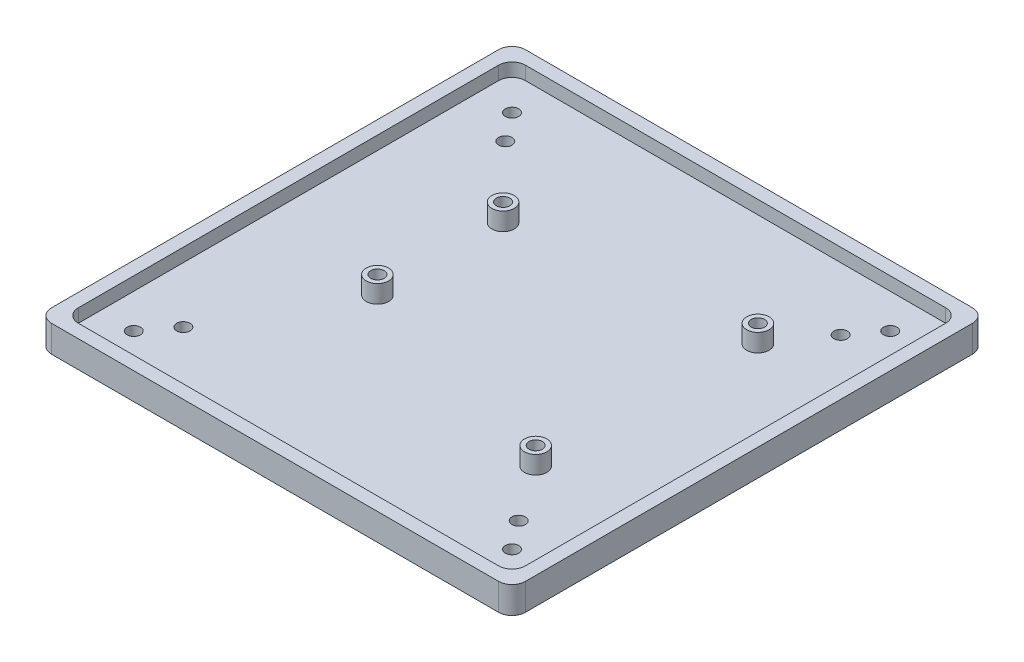
ISO-10303-21;
HEADER;
FILE_DESCRIPTION(('STEP AP214'),'2;1');
FILE_NAME('part.step','',(''),(''),'','','');
FILE_SCHEMA(('AUTOMOTIVE_DESIGN { 1 0 10303 214 1 1 1 1 }'));
ENDSEC;
DATA;
#1=APPLICATION_CONTEXT('core data for automotive mechanical design processes');
#2=APPLICATION_PROTOCOL_DEFINITION('international standard','automotive_design',2000,#1);
#3=PRODUCT_CONTEXT('',#1,'mechanical');
#4=PRODUCT('Part','Part','',(#3));
#5=PRODUCT_RELATED_PRODUCT_CATEGORY('part','',(#4));
#6=PRODUCT_DEFINITION_FORMATION('','',#4);
#7=PRODUCT_DEFINITION_CONTEXT('part definition',#1,'design');
#8=PRODUCT_DEFINITION('design','',#6,#7);
#9=PRODUCT_DEFINITION_SHAPE('','',#8);
#10=(LENGTH_UNIT() NAMED_UNIT(*) SI_UNIT(.MILLI.,.METRE.));
#11=(NAMED_UNIT(*) PLANE_ANGLE_UNIT() SI_UNIT($,.RADIAN.));
#12=(NAMED_UNIT(*) SI_UNIT($,.STERADIAN.) SOLID_ANGLE_UNIT());
#13=UNCERTAINTY_MEASURE_WITH_UNIT(LENGTH_MEASURE(1.E-05),#10,'distance_accuracy_value','');
#14=(GEOMETRIC_REPRESENTATION_CONTEXT(3) GLOBAL_UNCERTAINTY_ASSIGNED_CONTEXT((#13)) GLOBAL_UNIT_ASSIGNED_CONTEXT((#10,
#11,#12)) REPRESENTATION_CONTEXT('',''));
#15=CARTESIAN_POINT('',(0.,0.,0.));
#16=DIRECTION('',(0.,0.,1.));
#17=DIRECTION('',(1.,0.,0.));
#18=AXIS2_PLACEMENT_3D('',#15,#16,#17);
#19=CARTESIAN_POINT('',(0.,3.,0.));
#20=DIRECTION('',(0.,1.,0.));
#21=DIRECTION('',(0.,0.,1.));
#22=AXIS2_PLACEMENT_3D('',#19,#20,#21);
#23=PLANE('',#22);
#24=CARTESIAN_POINT('',(-14.5144151397927,3.,-37.));
#25=DIRECTION('',(0.,1.,0.));
#26=DIRECTION('',(0.,0.,1.));
#27=AXIS2_PLACEMENT_3D('',#24,#25,#26);
#28=CIRCLE('',#27,1.5);
#29=CARTESIAN_POINT('',(-14.5144151397927,3.,-35.5));
#30=VERTEX_POINT('',#29);
#31=EDGE_CURVE('E691',#30,#30,#28,.T.);
#32=ORIENTED_EDGE('',*,*,#31,.F.);
#33=EDGE_LOOP('',(#32));
#34=FACE_BOUND('',#33,.T.);
#35=CARTESIAN_POINT('',(60.4844151397927,3.,35.));
#36=DIRECTION('',(0.,1.,0.));
#37=DIRECTION('',(0.,0.,1.));
#38=AXIS2_PLACEMENT_3D('',#35,#36,#37);
#39=CIRCLE('',#38,1.5);
#40=CARTESIAN_POINT('',(60.4844151397927,3.,36.5));
#41=VERTEX_POINT('',#40);
#42=EDGE_CURVE('E697',#41,#41,#39,.T.);
#43=ORIENTED_EDGE('',*,*,#42,.F.);
#44=EDGE_LOOP('',(#43));
#45=FACE_BOUND('',#44,.T.);
#46=CARTESIAN_POINT('',(60.4844151397927,3.,-37.));
#47=DIRECTION('',(0.,1.,0.));
#48=DIRECTION('',(0.,0.,1.));
#49=AXIS2_PLACEMENT_3D('',#46,#47,#48);
#50=CIRCLE('',#49,1.5);
#51=CARTESIAN_POINT('',(60.4844151397927,3.,-35.5));
#52=VERTEX_POINT('',#51);
#53=EDGE_CURVE('E705',#52,#52,#50,.T.);
#54=ORIENTED_EDGE('',*,*,#53,.F.);
#55=EDGE_LOOP('',(#54));
#56=FACE_BOUND('',#55,.T.);
#57=CARTESIAN_POINT('',(-14.5144151397927,3.,35.));
#58=DIRECTION('',(0.,1.,0.));
#59=DIRECTION('',(0.,0.,1.));
#60=AXIS2_PLACEMENT_3D('',#57,#58,#59);
#61=CIRCLE('',#60,1.5);
#62=CARTESIAN_POINT('',(-14.5144151397927,3.,36.5));
#63=VERTEX_POINT('',#62);
#64=EDGE_CURVE('E694',#63,#63,#61,.T.);
#65=ORIENTED_EDGE('',*,*,#64,.F.);
#66=EDGE_LOOP('',(#65));
#67=FACE_BOUND('',#66,.T.);
#68=CARTESIAN_POINT('',(65.2844151397927,3.,-43.3));
#69=DIRECTION('',(0.,1.,0.));
#70=DIRECTION('',(0.,0.,1.));
#71=AXIS2_PLACEMENT_3D('',#68,#69,#70);
#72=CIRCLE('',#71,1.5);
#73=CARTESIAN_POINT('',(65.2844151397927,3.,-41.8));
#74=VERTEX_POINT('',#73);
#75=EDGE_CURVE('E251',#74,#74,#72,.T.);
#76=ORIENTED_EDGE('',*,*,#75,.F.);
#77=EDGE_LOOP('',(#76));
#78=FACE_BOUND('',#77,.T.);
#79=CARTESIAN_POINT('',(-19.3144151397927,3.,41.3));
#80=DIRECTION('',(0.,1.,0.));
#81=DIRECTION('',(0.,0.,1.));
#82=AXIS2_PLACEMENT_3D('',#79,#80,#81);
#83=CIRCLE('',#82,1.5);
#84=CARTESIAN_POINT('',(-19.3144151397927,3.,42.8));
#85=VERTEX_POINT('',#84);
#86=EDGE_CURVE('E714',#85,#85,#83,.T.);
#87=ORIENTED_EDGE('',*,*,#86,.F.);
#88=EDGE_LOOP('',(#87));
#89=FACE_BOUND('',#88,.T.);
#90=CARTESIAN_POINT('',(-19.3144151397927,3.,-43.3));
#91=DIRECTION('',(0.,1.,0.));
#92=DIRECTION('',(0.,0.,1.));
#93=AXIS2_PLACEMENT_3D('',#90,#91,#92);
#94=CIRCLE('',#93,1.5);
#95=CARTESIAN_POINT('',(-19.3144151397927,3.,-41.8));
#96=VERTEX_POINT('',#95);
#97=EDGE_CURVE('E264',#96,#96,#94,.T.);
#98=ORIENTED_EDGE('',*,*,#97,.F.);
#99=EDGE_LOOP('',(#98));
#100=FACE_BOUND('',#99,.T.);
#101=CARTESIAN_POINT('',(65.2844151397927,3.,41.3));
#102=DIRECTION('',(0.,1.,0.));
#103=DIRECTION('',(0.,0.,1.));
#104=AXIS2_PLACEMENT_3D('',#101,#102,#103);
#105=CIRCLE('',#104,1.5);
#106=CARTESIAN_POINT('',(65.2844151397927,3.,42.8));
#107=VERTEX_POINT('',#106);
#108=EDGE_CURVE('E247',#107,#107,#105,.T.);
#109=ORIENTED_EDGE('',*,*,#108,.F.);
#110=EDGE_LOOP('',(#109));
#111=FACE_BOUND('',#110,.T.);
#112=DIRECTION('',(0.,0.,-1.));
#113=VECTOR('',#112,1.);
#114=CARTESIAN_POINT('',(-27.0144151397927,3.,-61.9053418737465));
#115=LINE('',#114,#113);
#116=CARTESIAN_POINT('',(-27.0144151397927,3.,46.));
#117=VERTEX_POINT('',#116);
#118=CARTESIAN_POINT('',(-27.0144151397927,3.,-48.));
#119=VERTEX_POINT('',#118);
#120=EDGE_CURVE('E179',#117,#119,#115,.T.);
#121=ORIENTED_EDGE('',*,*,#120,.F.);
#122=CARTESIAN_POINT('',(-24.0144151397927,3.,46.));
#123=DIRECTION('',(0.,1.,0.));
#124=DIRECTION('',(0.,0.,1.));
#125=AXIS2_PLACEMENT_3D('',#122,#123,#124);
#126=CIRCLE('',#125,3.);
#127=CARTESIAN_POINT('',(-24.0144151397927,3.,49.));
#128=VERTEX_POINT('',#127);
#129=EDGE_CURVE('E227',#117,#128,#126,.T.);
#130=ORIENTED_EDGE('',*,*,#129,.T.);
#131=DIRECTION('',(1.,0.,0.));
#132=VECTOR('',#131,1.);
#133=CARTESIAN_POINT('',(-72.9844151397927,3.,49.));
#134=LINE('',#133,#132);
#135=CARTESIAN_POINT('',(69.9844151397927,3.,49.));
#136=VERTEX_POINT('',#135);
#137=EDGE_CURVE('E292',#128,#136,#134,.T.);
#138=ORIENTED_EDGE('',*,*,#137,.T.);
#139=CARTESIAN_POINT('',(69.9844151397927,3.,46.));
#140=DIRECTION('',(0.,1.,0.));
#141=DIRECTION('',(0.,0.,1.));
#142=AXIS2_PLACEMENT_3D('',#139,#140,#141);
#143=CIRCLE('',#142,3.);
#144=CARTESIAN_POINT('',(72.9844151397927,3.,46.));
#145=VERTEX_POINT('',#144);
#146=EDGE_CURVE('E223',#136,#145,#143,.T.);
#147=ORIENTED_EDGE('',*,*,#146,.T.);
#148=DIRECTION('',(0.,0.,-1.));
#149=VECTOR('',#148,1.);
#150=CARTESIAN_POINT('',(72.9844151397927,3.,-51.));
#151=LINE('',#150,#149);
#152=CARTESIAN_POINT('',(72.9844151397927,3.,-48.));
#153=VERTEX_POINT('',#152);
#154=EDGE_CURVE('E296',#145,#153,#151,.T.);
#155=ORIENTED_EDGE('',*,*,#154,.T.);
#156=CARTESIAN_POINT('',(69.9844151397927,3.,-48.));
#157=DIRECTION('',(0.,1.,0.));
#158=DIRECTION('',(0.,0.,1.));
#159=AXIS2_PLACEMENT_3D('',#156,#157,#158);
#160=CIRCLE('',#159,3.);
#161=CARTESIAN_POINT('',(69.9844151397927,3.,-51.));
#162=VERTEX_POINT('',#161);
#163=EDGE_CURVE('E59',#153,#162,#160,.T.);
#164=ORIENTED_EDGE('',*,*,#163,.T.);
#165=DIRECTION('',(-1.,0.,0.));
#166=VECTOR('',#165,1.);
#167=CARTESIAN_POINT('',(-72.9844151397927,3.,-51.));
#168=LINE('',#167,#166);
#169=CARTESIAN_POINT('',(-24.0144151397927,3.,-51.));
#170=VERTEX_POINT('',#169);
#171=EDGE_CURVE('E293',#162,#170,#168,.T.);
#172=ORIENTED_EDGE('',*,*,#171,.T.);
#173=CARTESIAN_POINT('',(-24.0144151397927,3.,-48.));
#174=DIRECTION('',(0.,1.,0.));
#175=DIRECTION('',(0.,0.,1.));
#176=AXIS2_PLACEMENT_3D('',#173,#174,#175);
#177=CIRCLE('',#176,3.);
#178=EDGE_CURVE('E225',#170,#119,#177,.T.);
#179=ORIENTED_EDGE('',*,*,#178,.T.);
#180=EDGE_LOOP('',(#121,#130,#138,#147,#155,#164,#172,#179));
#181=FACE_BOUND('',#180,.T.);
#182=CARTESIAN_POINT('',(0.984415139792674,3.,7.10000000000003));
#183=DIRECTION('',(0.,1.,0.));
#184=DIRECTION('',(0.,0.,1.));
#185=AXIS2_PLACEMENT_3D('',#182,#183,#184);
#186=CIRCLE('',#185,2.5);
#187=CARTESIAN_POINT('',(0.984415139792674,3.,9.60000000000003));
#188=VERTEX_POINT('',#187);
#189=EDGE_CURVE('E332',#188,#188,#186,.T.);
#190=ORIENTED_EDGE('',*,*,#189,.F.);
#191=EDGE_LOOP('',(#190));
#192=FACE_BOUND('',#191,.T.);
#193=CARTESIAN_POINT('',(51.7844151397927,3.,22.5));
#194=DIRECTION('',(0.,1.,0.));
#195=DIRECTION('',(0.,0.,1.));
#196=AXIS2_PLACEMENT_3D('',#193,#194,#195);
#197=CIRCLE('',#196,2.5);
#198=CARTESIAN_POINT('',(51.7844151397927,3.,25.));
#199=VERTEX_POINT('',#198);
#200=EDGE_CURVE('E312',#199,#199,#197,.T.);
#201=ORIENTED_EDGE('',*,*,#200,.F.);
#202=EDGE_LOOP('',(#201));
#203=FACE_BOUND('',#202,.T.);
#204=CARTESIAN_POINT('',(52.9844151397927,3.,-26.));
#205=DIRECTION('',(0.,1.,0.));
#206=DIRECTION('',(0.,0.,1.));
#207=AXIS2_PLACEMENT_3D('',#204,#205,#206);
#208=CIRCLE('',#207,2.5);
#209=CARTESIAN_POINT('',(52.9844151397927,3.,-23.5));
#210=VERTEX_POINT('',#209);
#211=EDGE_CURVE('E323',#210,#210,#208,.T.);
#212=ORIENTED_EDGE('',*,*,#211,.F.);
#213=EDGE_LOOP('',(#212));
#214=FACE_BOUND('',#213,.T.);
#215=CARTESIAN_POINT('',(0.984415139792701,3.,-21.));
#216=DIRECTION('',(0.,1.,0.));
#217=DIRECTION('',(0.,0.,1.));
#218=AXIS2_PLACEMENT_3D('',#215,#216,#217);
#219=CIRCLE('',#218,2.5);
#220=CARTESIAN_POINT('',(0.984415139792701,3.,-18.5));
#221=VERTEX_POINT('',#220);
#222=EDGE_CURVE('E184',#221,#221,#219,.T.);
#223=ORIENTED_EDGE('',*,*,#222,.F.);
#224=EDGE_LOOP('',(#223));
#225=FACE_BOUND('',#224,.T.);
#226=ADVANCED_FACE('F35',(#34,#45,#56,#67,#78,#89,#100,#111,#181,#192,#203,#214,#225),#23,.T.);
#227=CARTESIAN_POINT('',(0.,0.,0.));
#228=DIRECTION('',(0.,1.,0.));
#229=DIRECTION('',(0.,0.,1.));
#230=AXIS2_PLACEMENT_3D('',#227,#228,#229);
#231=PLANE('',#230);
#232=CARTESIAN_POINT('',(-14.5144151397927,0.,-37.));
#233=DIRECTION('',(0.,1.,0.));
#234=DIRECTION('',(0.,0.,1.));
#235=AXIS2_PLACEMENT_3D('',#232,#233,#234);
#236=CIRCLE('',#235,1.5);
#237=CARTESIAN_POINT('',(-14.5144151397927,0.,-35.5));
#238=VERTEX_POINT('',#237);
#239=EDGE_CURVE('E689',#238,#238,#236,.T.);
#240=ORIENTED_EDGE('',*,*,#239,.T.);
#241=EDGE_LOOP('',(#240));
#242=FACE_BOUND('',#241,.T.);
#243=CARTESIAN_POINT('',(60.4844151397927,0.,35.));
#244=DIRECTION('',(0.,1.,0.));
#245=DIRECTION('',(0.,0.,1.));
#246=AXIS2_PLACEMENT_3D('',#243,#244,#245);
#247=CIRCLE('',#246,1.5);
#248=CARTESIAN_POINT('',(60.4844151397927,0.,36.5));
#249=VERTEX_POINT('',#248);
#250=EDGE_CURVE('E692',#249,#249,#247,.T.);
#251=ORIENTED_EDGE('',*,*,#250,.T.);
#252=EDGE_LOOP('',(#251));
#253=FACE_BOUND('',#252,.T.);
#254=CARTESIAN_POINT('',(60.4844151397927,0.,-37.));
#255=DIRECTION('',(0.,1.,0.));
#256=DIRECTION('',(0.,0.,1.));
#257=AXIS2_PLACEMENT_3D('',#254,#255,#256);
#258=CIRCLE('',#257,1.5);
#259=CARTESIAN_POINT('',(60.4844151397927,0.,-35.5));
#260=VERTEX_POINT('',#259);
#261=EDGE_CURVE('E702',#260,#260,#258,.T.);
#262=ORIENTED_EDGE('',*,*,#261,.T.);
#263=EDGE_LOOP('',(#262));
#264=FACE_BOUND('',#263,.T.);
#265=CARTESIAN_POINT('',(-14.5144151397927,0.,35.));
#266=DIRECTION('',(0.,1.,0.));
#267=DIRECTION('',(0.,0.,1.));
#268=AXIS2_PLACEMENT_3D('',#265,#266,#267);
#269=CIRCLE('',#268,1.5);
#270=CARTESIAN_POINT('',(-14.5144151397927,0.,36.5));
#271=VERTEX_POINT('',#270);
#272=EDGE_CURVE('E708',#271,#271,#269,.T.);
#273=ORIENTED_EDGE('',*,*,#272,.T.);
#274=EDGE_LOOP('',(#273));
#275=FACE_BOUND('',#274,.T.);
#276=CARTESIAN_POINT('',(65.2844151397927,0.,-43.3));
#277=DIRECTION('',(0.,1.,0.));
#278=DIRECTION('',(0.,0.,1.));
#279=AXIS2_PLACEMENT_3D('',#276,#277,#278);
#280=CIRCLE('',#279,1.5);
#281=CARTESIAN_POINT('',(65.2844151397927,0.,-41.8));
#282=VERTEX_POINT('',#281);
#283=EDGE_CURVE('E39',#282,#282,#280,.T.);
#284=ORIENTED_EDGE('',*,*,#283,.T.);
#285=EDGE_LOOP('',(#284));
#286=FACE_BOUND('',#285,.T.);
#287=CARTESIAN_POINT('',(-19.3144151397927,0.,41.3));
#288=DIRECTION('',(0.,1.,0.));
#289=DIRECTION('',(0.,0.,1.));
#290=AXIS2_PLACEMENT_3D('',#287,#288,#289);
#291=CIRCLE('',#290,1.5);
#292=CARTESIAN_POINT('',(-19.3144151397927,0.,42.8));
#293=VERTEX_POINT('',#292);
#294=EDGE_CURVE('E250',#293,#293,#291,.T.);
#295=ORIENTED_EDGE('',*,*,#294,.T.);
#296=EDGE_LOOP('',(#295));
#297=FACE_BOUND('',#296,.T.);
#298=CARTESIAN_POINT('',(-19.3144151397927,0.,-43.3));
#299=DIRECTION('',(0.,1.,0.));
#300=DIRECTION('',(0.,0.,1.));
#301=AXIS2_PLACEMENT_3D('',#298,#299,#300);
#302=CIRCLE('',#301,1.5);
#303=CARTESIAN_POINT('',(-19.3144151397927,0.,-41.8));
#304=VERTEX_POINT('',#303);
#305=EDGE_CURVE('E248',#304,#304,#302,.T.);
#306=ORIENTED_EDGE('',*,*,#305,.T.);
#307=EDGE_LOOP('',(#306));
#308=FACE_BOUND('',#307,.T.);
#309=CARTESIAN_POINT('',(65.2844151397927,0.,41.3));
#310=DIRECTION('',(0.,1.,0.));
#311=DIRECTION('',(0.,0.,1.));
#312=AXIS2_PLACEMENT_3D('',#309,#310,#311);
#313=CIRCLE('',#312,1.5);
#314=CARTESIAN_POINT('',(65.2844151397927,0.,42.8));
#315=VERTEX_POINT('',#314);
#316=EDGE_CURVE('E243',#315,#315,#313,.T.);
#317=ORIENTED_EDGE('',*,*,#316,.T.);
#318=EDGE_LOOP('',(#317));
#319=FACE_BOUND('',#318,.T.);
#320=CARTESIAN_POINT('',(52.9844151397927,0.,-26.));
#321=DIRECTION('',(0.,1.,0.));
#322=DIRECTION('',(0.,0.,1.));
#323=AXIS2_PLACEMENT_3D('',#320,#321,#322);
#324=CIRCLE('',#323,1.5);
#325=CARTESIAN_POINT('',(52.9844151397927,0.,-24.5));
#326=VERTEX_POINT('',#325);
#327=EDGE_CURVE('E295',#326,#326,#324,.T.);
#328=ORIENTED_EDGE('',*,*,#327,.T.);
#329=EDGE_LOOP('',(#328));
#330=FACE_BOUND('',#329,.T.);
#331=CARTESIAN_POINT('',(0.984415139792701,0.,-21.));
#332=DIRECTION('',(0.,1.,0.));
#333=DIRECTION('',(0.,0.,1.));
#334=AXIS2_PLACEMENT_3D('',#331,#332,#333);
#335=CIRCLE('',#334,1.5);
#336=CARTESIAN_POINT('',(0.984415139792701,0.,-19.5));
#337=VERTEX_POINT('',#336);
#338=EDGE_CURVE('E302',#337,#337,#335,.T.);
#339=ORIENTED_EDGE('',*,*,#338,.T.);
#340=EDGE_LOOP('',(#339));
#341=FACE_BOUND('',#340,.T.);
#342=CARTESIAN_POINT('',(0.984415139792674,0.,7.10000000000003));
#343=DIRECTION('',(0.,1.,0.));
#344=DIRECTION('',(0.,0.,1.));
#345=AXIS2_PLACEMENT_3D('',#342,#343,#344);
#346=CIRCLE('',#345,1.5);
#347=CARTESIAN_POINT('',(0.984415139792674,0.,8.60000000000003));
#348=VERTEX_POINT('',#347);
#349=EDGE_CURVE('E305',#348,#348,#346,.T.);
#350=ORIENTED_EDGE('',*,*,#349,.T.);
#351=EDGE_LOOP('',(#350));
#352=FACE_BOUND('',#351,.T.);
#353=CARTESIAN_POINT('',(51.7844151397927,0.,22.5));
#354=DIRECTION('',(0.,1.,0.));
#355=DIRECTION('',(0.,0.,1.));
#356=AXIS2_PLACEMENT_3D('',#353,#354,#355);
#357=CIRCLE('',#356,1.5);
#358=CARTESIAN_POINT('',(51.7844151397927,0.,24.));
#359=VERTEX_POINT('',#358);
#360=EDGE_CURVE('E308',#359,#359,#357,.T.);
#361=ORIENTED_EDGE('',*,*,#360,.T.);
#362=EDGE_LOOP('',(#361));
#363=FACE_BOUND('',#362,.T.);
#364=DIRECTION('',(0.,0.,1.));
#365=VECTOR('',#364,1.);
#366=CARTESIAN_POINT('',(-30.0144151397927,0.,-54.));
#367=LINE('',#366,#365);
#368=CARTESIAN_POINT('',(-30.0144151397927,0.,-51.));
#369=VERTEX_POINT('',#368);
#370=CARTESIAN_POINT('',(-30.0144151397927,0.,49.));
#371=VERTEX_POINT('',#370);
#372=EDGE_CURVE('E283',#369,#371,#367,.T.);
#373=ORIENTED_EDGE('',*,*,#372,.F.);
#374=CARTESIAN_POINT('',(-27.0144151397927,0.,-51.));
#375=DIRECTION('',(0.,1.,0.));
#376=DIRECTION('',(0.,0.,1.));
#377=AXIS2_PLACEMENT_3D('',#374,#375,#376);
#378=CIRCLE('',#377,3.);
#379=CARTESIAN_POINT('',(-27.0144151397927,0.,-54.));
#380=VERTEX_POINT('',#379);
#381=EDGE_CURVE('E201',#369,#380,#378,.F.);
#382=ORIENTED_EDGE('',*,*,#381,.T.);
#383=DIRECTION('',(-1.,0.,0.));
#384=VECTOR('',#383,1.);
#385=CARTESIAN_POINT('',(75.9844151397927,0.,-54.));
#386=LINE('',#385,#384);
#387=CARTESIAN_POINT('',(72.9844151397927,0.,-54.));
#388=VERTEX_POINT('',#387);
#389=EDGE_CURVE('E281',#388,#380,#386,.T.);
#390=ORIENTED_EDGE('',*,*,#389,.F.);
#391=CARTESIAN_POINT('',(72.9844151397927,0.,-51.));
#392=DIRECTION('',(0.,1.,0.));
#393=DIRECTION('',(0.,0.,1.));
#394=AXIS2_PLACEMENT_3D('',#391,#392,#393);
#395=CIRCLE('',#394,3.);
#396=CARTESIAN_POINT('',(75.9844151397927,0.,-51.));
#397=VERTEX_POINT('',#396);
#398=EDGE_CURVE('E178',#388,#397,#395,.F.);
#399=ORIENTED_EDGE('',*,*,#398,.T.);
#400=DIRECTION('',(0.,0.,-1.));
#401=VECTOR('',#400,1.);
#402=CARTESIAN_POINT('',(75.9844151397927,0.,52.));
#403=LINE('',#402,#401);
#404=CARTESIAN_POINT('',(75.9844151397927,0.,49.));
#405=VERTEX_POINT('',#404);
#406=EDGE_CURVE('E289',#405,#397,#403,.T.);
#407=ORIENTED_EDGE('',*,*,#406,.F.);
#408=CARTESIAN_POINT('',(72.9844151397927,0.,49.));
#409=DIRECTION('',(0.,1.,0.));
#410=DIRECTION('',(0.,0.,1.));
#411=AXIS2_PLACEMENT_3D('',#408,#409,#410);
#412=CIRCLE('',#411,3.);
#413=CARTESIAN_POINT('',(72.9844151397927,0.,52.));
#414=VERTEX_POINT('',#413);
#415=EDGE_CURVE('E198',#405,#414,#412,.F.);
#416=ORIENTED_EDGE('',*,*,#415,.T.);
#417=DIRECTION('',(1.,0.,0.));
#418=VECTOR('',#417,1.);
#419=CARTESIAN_POINT('',(-30.0144151397927,0.,52.));
#420=LINE('',#419,#418);
#421=CARTESIAN_POINT('',(-27.0144151397927,0.,52.));
#422=VERTEX_POINT('',#421);
#423=EDGE_CURVE('E286',#422,#414,#420,.T.);
#424=ORIENTED_EDGE('',*,*,#423,.F.);
#425=CARTESIAN_POINT('',(-27.0144151397927,0.,49.));
#426=DIRECTION('',(0.,1.,0.));
#427=DIRECTION('',(0.,0.,1.));
#428=AXIS2_PLACEMENT_3D('',#425,#426,#427);
#429=CIRCLE('',#428,3.);
#430=EDGE_CURVE('E196',#422,#371,#429,.F.);
#431=ORIENTED_EDGE('',*,*,#430,.T.);
#432=EDGE_LOOP('',(#373,#382,#390,#399,#407,#416,#424,#431));
#433=FACE_BOUND('',#432,.T.);
#434=ADVANCED_FACE('F365',(#242,#253,#264,#275,#286,#297,#308,#319,#330,#341,#352,#363,#433),
#231,.F.);
#435=CARTESIAN_POINT('',(52.9844151397927,3.,-26.));
#436=DIRECTION('',(0.,-1.,0.));
#437=DIRECTION('',(0.,0.,-1.));
#438=AXIS2_PLACEMENT_3D('',#435,#436,#437);
#439=CYLINDRICAL_SURFACE('',#438,1.5);
#440=ORIENTED_EDGE('',*,*,#327,.F.);
#441=EDGE_LOOP('',(#440));
#442=FACE_BOUND('',#441,.T.);
#443=CARTESIAN_POINT('',(52.9844151397927,7.,-26.));
#444=DIRECTION('',(0.,1.,0.));
#445=DIRECTION('',(0.,0.,1.));
#446=AXIS2_PLACEMENT_3D('',#443,#444,#445);
#447=CIRCLE('',#446,1.5);
#448=CARTESIAN_POINT('',(52.9844151397927,7.,-24.5));
#449=VERTEX_POINT('',#448);
#450=EDGE_CURVE('E311',#449,#449,#447,.T.);
#451=ORIENTED_EDGE('',*,*,#450,.T.);
#452=EDGE_LOOP('',(#451));
#453=FACE_BOUND('',#452,.T.);
#454=ADVANCED_FACE('F372',(#442,#453),#439,.F.);
#455=CARTESIAN_POINT('',(0.984415139792701,3.,-21.));
#456=DIRECTION('',(0.,-1.,0.));
#457=DIRECTION('',(0.,0.,-1.));
#458=AXIS2_PLACEMENT_3D('',#455,#456,#457);
#459=CYLINDRICAL_SURFACE('',#458,1.5);
#460=ORIENTED_EDGE('',*,*,#338,.F.);
#461=EDGE_LOOP('',(#460));
#462=FACE_BOUND('',#461,.T.);
#463=CARTESIAN_POINT('',(0.984415139792701,7.,-21.));
#464=DIRECTION('',(0.,1.,0.));
#465=DIRECTION('',(0.,0.,1.));
#466=AXIS2_PLACEMENT_3D('',#463,#464,#465);
#467=CIRCLE('',#466,1.5);
#468=CARTESIAN_POINT('',(0.984415139792701,7.,-19.5));
#469=VERTEX_POINT('',#468);
#470=EDGE_CURVE('E331',#469,#469,#467,.T.);
#471=ORIENTED_EDGE('',*,*,#470,.T.);
#472=EDGE_LOOP('',(#471));
#473=FACE_BOUND('',#472,.T.);
#474=ADVANCED_FACE('F346',(#462,#473),#459,.F.);
#475=CARTESIAN_POINT('',(0.984415139792674,3.,7.10000000000003));
#476=DIRECTION('',(0.,-1.,0.));
#477=DIRECTION('',(0.,0.,-1.));
#478=AXIS2_PLACEMENT_3D('',#475,#476,#477);
#479=CYLINDRICAL_SURFACE('',#478,1.5);
#480=ORIENTED_EDGE('',*,*,#349,.F.);
#481=EDGE_LOOP('',(#480));
#482=FACE_BOUND('',#481,.T.);
#483=CARTESIAN_POINT('',(0.984415139792674,7.,7.10000000000003));
#484=DIRECTION('',(0.,1.,0.));
#485=DIRECTION('',(0.,0.,1.));
#486=AXIS2_PLACEMENT_3D('',#483,#484,#485);
#487=CIRCLE('',#486,1.5);
#488=CARTESIAN_POINT('',(0.984415139792674,7.,8.60000000000004));
#489=VERTEX_POINT('',#488);
#490=EDGE_CURVE('E322',#489,#489,#487,.T.);
#491=ORIENTED_EDGE('',*,*,#490,.T.);
#492=EDGE_LOOP('',(#491));
#493=FACE_BOUND('',#492,.T.);
#494=ADVANCED_FACE('F384',(#482,#493),#479,.F.);
#495=CARTESIAN_POINT('',(51.7844151397927,3.,22.5));
#496=DIRECTION('',(0.,-1.,0.));
#497=DIRECTION('',(0.,0.,-1.));
#498=AXIS2_PLACEMENT_3D('',#495,#496,#497);
#499=CYLINDRICAL_SURFACE('',#498,1.5);
#500=ORIENTED_EDGE('',*,*,#360,.F.);
#501=EDGE_LOOP('',(#500));
#502=FACE_BOUND('',#501,.T.);
#503=CARTESIAN_POINT('',(51.7844151397927,7.,22.5));
#504=DIRECTION('',(0.,1.,0.));
#505=DIRECTION('',(0.,0.,1.));
#506=AXIS2_PLACEMENT_3D('',#503,#504,#505);
#507=CIRCLE('',#506,1.5);
#508=CARTESIAN_POINT('',(51.7844151397927,7.,24.));
#509=VERTEX_POINT('',#508);
#510=EDGE_CURVE('E319',#509,#509,#507,.T.);
#511=ORIENTED_EDGE('',*,*,#510,.T.);
#512=EDGE_LOOP('',(#511));
#513=FACE_BOUND('',#512,.T.);
#514=ADVANCED_FACE('F388',(#502,#513),#499,.F.);
#515=CARTESIAN_POINT('',(51.7844151397927,7.,22.5));
#516=DIRECTION('',(0.,1.,0.));
#517=DIRECTION('',(0.,0.,1.));
#518=AXIS2_PLACEMENT_3D('',#515,#516,#517);
#519=PLANE('',#518);
#520=CARTESIAN_POINT('',(51.7844151397927,7.,22.5));
#521=DIRECTION('',(0.,1.,0.));
#522=DIRECTION('',(0.,0.,1.));
#523=AXIS2_PLACEMENT_3D('',#520,#521,#522);
#524=CIRCLE('',#523,2.5);
#525=CARTESIAN_POINT('',(51.7844151397927,7.,25.));
#526=VERTEX_POINT('',#525);
#527=EDGE_CURVE('E316',#526,#526,#524,.T.);
#528=ORIENTED_EDGE('',*,*,#527,.T.);
#529=EDGE_LOOP('',(#528));
#530=FACE_BOUND('',#529,.T.);
#531=ORIENTED_EDGE('',*,*,#510,.F.);
#532=EDGE_LOOP('',(#531));
#533=FACE_BOUND('',#532,.T.);
#534=ADVANCED_FACE('F392',(#530,#533),#519,.T.);
#535=CARTESIAN_POINT('',(51.7844151397927,7.,22.5));
#536=DIRECTION('',(0.,-1.,0.));
#537=DIRECTION('',(0.,0.,-1.));
#538=AXIS2_PLACEMENT_3D('',#535,#536,#537);
#539=CYLINDRICAL_SURFACE('',#538,2.5);
#540=ORIENTED_EDGE('',*,*,#527,.F.);
#541=EDGE_LOOP('',(#540));
#542=FACE_BOUND('',#541,.T.);
#543=ORIENTED_EDGE('',*,*,#200,.T.);
#544=EDGE_LOOP('',(#543));
#545=FACE_BOUND('',#544,.T.);
#546=ADVANCED_FACE('F394',(#542,#545),#539,.T.);
#547=CARTESIAN_POINT('',(52.9844151397927,7.,-26.));
#548=DIRECTION('',(0.,1.,0.));
#549=DIRECTION('',(0.,0.,1.));
#550=AXIS2_PLACEMENT_3D('',#547,#548,#549);
#551=PLANE('',#550);
#552=CARTESIAN_POINT('',(52.9844151397927,7.,-26.));
#553=DIRECTION('',(0.,1.,0.));
#554=DIRECTION('',(0.,0.,1.));
#555=AXIS2_PLACEMENT_3D('',#552,#553,#554);
#556=CIRCLE('',#555,2.5);
#557=CARTESIAN_POINT('',(52.9844151397927,7.,-23.5));
#558=VERTEX_POINT('',#557);
#559=EDGE_CURVE('E315',#558,#558,#556,.T.);
#560=ORIENTED_EDGE('',*,*,#559,.T.);
#561=EDGE_LOOP('',(#560));
#562=FACE_BOUND('',#561,.T.);
#563=ORIENTED_EDGE('',*,*,#450,.F.);
#564=EDGE_LOOP('',(#563));
#565=FACE_BOUND('',#564,.T.);
#566=ADVANCED_FACE('F397',(#562,#565),#551,.T.);
#567=CARTESIAN_POINT('',(52.9844151397927,7.,-26.));
#568=DIRECTION('',(0.,-1.,0.));
#569=DIRECTION('',(0.,0.,-1.));
#570=AXIS2_PLACEMENT_3D('',#567,#568,#569);
#571=CYLINDRICAL_SURFACE('',#570,2.5);
#572=ORIENTED_EDGE('',*,*,#559,.F.);
#573=EDGE_LOOP('',(#572));
#574=FACE_BOUND('',#573,.T.);
#575=ORIENTED_EDGE('',*,*,#211,.T.);
#576=EDGE_LOOP('',(#575));
#577=FACE_BOUND('',#576,.T.);
#578=ADVANCED_FACE('F402',(#574,#577),#571,.T.);
#579=CARTESIAN_POINT('',(0.984415139792674,7.,7.10000000000003));
#580=DIRECTION('',(0.,1.,0.));
#581=DIRECTION('',(0.,0.,1.));
#582=AXIS2_PLACEMENT_3D('',#579,#580,#581);
#583=PLANE('',#582);
#584=CARTESIAN_POINT('',(0.984415139792674,7.,7.10000000000003));
#585=DIRECTION('',(0.,1.,0.));
#586=DIRECTION('',(0.,0.,1.));
#587=AXIS2_PLACEMENT_3D('',#584,#585,#586);
#588=CIRCLE('',#587,2.5);
#589=CARTESIAN_POINT('',(0.984415139792674,7.,9.60000000000003));
#590=VERTEX_POINT('',#589);
#591=EDGE_CURVE('E326',#590,#590,#588,.T.);
#592=ORIENTED_EDGE('',*,*,#591,.T.);
#593=EDGE_LOOP('',(#592));
#594=FACE_BOUND('',#593,.T.);
#595=ORIENTED_EDGE('',*,*,#490,.F.);
#596=EDGE_LOOP('',(#595));
#597=FACE_BOUND('',#596,.T.);
#598=ADVANCED_FACE('F360',(#594,#597),#583,.T.);
#599=CARTESIAN_POINT('',(0.984415139792674,7.,7.10000000000003));
#600=DIRECTION('',(0.,-1.,0.));
#601=DIRECTION('',(0.,0.,-1.));
#602=AXIS2_PLACEMENT_3D('',#599,#600,#601);
#603=CYLINDRICAL_SURFACE('',#602,2.5);
#604=ORIENTED_EDGE('',*,*,#591,.F.);
#605=EDGE_LOOP('',(#604));
#606=FACE_BOUND('',#605,.T.);
#607=ORIENTED_EDGE('',*,*,#189,.T.);
#608=EDGE_LOOP('',(#607));
#609=FACE_BOUND('',#608,.T.);
#610=ADVANCED_FACE('F351',(#606,#609),#603,.T.);
#611=CARTESIAN_POINT('',(0.984415139792701,7.,-21.));
#612=DIRECTION('',(0.,1.,0.));
#613=DIRECTION('',(0.,0.,1.));
#614=AXIS2_PLACEMENT_3D('',#611,#612,#613);
#615=PLANE('',#614);
#616=CARTESIAN_POINT('',(0.984415139792701,7.,-21.));
#617=DIRECTION('',(0.,1.,0.));
#618=DIRECTION('',(0.,0.,1.));
#619=AXIS2_PLACEMENT_3D('',#616,#617,#618);
#620=CIRCLE('',#619,2.5);
#621=CARTESIAN_POINT('',(0.984415139792701,7.,-18.5));
#622=VERTEX_POINT('',#621);
#623=EDGE_CURVE('E335',#622,#622,#620,.T.);
#624=ORIENTED_EDGE('',*,*,#623,.T.);
#625=EDGE_LOOP('',(#624));
#626=FACE_BOUND('',#625,.T.);
#627=ORIENTED_EDGE('',*,*,#470,.F.);
#628=EDGE_LOOP('',(#627));
#629=FACE_BOUND('',#628,.T.);
#630=ADVANCED_FACE('F348',(#626,#629),#615,.T.);
#631=CARTESIAN_POINT('',(0.984415139792701,7.,-21.));
#632=DIRECTION('',(0.,-1.,0.));
#633=DIRECTION('',(0.,0.,-1.));
#634=AXIS2_PLACEMENT_3D('',#631,#632,#633);
#635=CYLINDRICAL_SURFACE('',#634,2.5);
#636=ORIENTED_EDGE('',*,*,#623,.F.);
#637=EDGE_LOOP('',(#636));
#638=FACE_BOUND('',#637,.T.);
#639=ORIENTED_EDGE('',*,*,#222,.T.);
#640=EDGE_LOOP('',(#639));
#641=FACE_BOUND('',#640,.T.);
#642=ADVANCED_FACE('F350',(#638,#641),#635,.T.);
#643=CARTESIAN_POINT('',(75.9844151397927,0.,-54.));
#644=DIRECTION('',(0.,0.,-1.));
#645=DIRECTION('',(-1.,0.,0.));
#646=AXIS2_PLACEMENT_3D('',#643,#644,#645);
#647=PLANE('',#646);
#648=ORIENTED_EDGE('',*,*,#389,.T.);
#649=DIRECTION('',(0.,1.,0.));
#650=VECTOR('',#649,1.);
#651=CARTESIAN_POINT('',(-27.0144151397927,0.,-54.));
#652=LINE('',#651,#650);
#653=CARTESIAN_POINT('',(-27.0144151397927,6.,-54.));
#654=VERTEX_POINT('',#653);
#655=EDGE_CURVE('E172',#380,#654,#652,.T.);
#656=ORIENTED_EDGE('',*,*,#655,.T.);
#657=DIRECTION('',(-1.,0.,0.));
#658=VECTOR('',#657,1.);
#659=CARTESIAN_POINT('',(75.9844151397927,6.,-54.));
#660=LINE('',#659,#658);
#661=CARTESIAN_POINT('',(72.9844151397927,6.,-54.));
#662=VERTEX_POINT('',#661);
#663=EDGE_CURVE('E155',#662,#654,#660,.T.);
#664=ORIENTED_EDGE('',*,*,#663,.F.);
#665=DIRECTION('',(0.,1.,0.));
#666=VECTOR('',#665,1.);
#667=CARTESIAN_POINT('',(72.9844151397927,0.,-54.));
#668=LINE('',#667,#666);
#669=EDGE_CURVE('E169',#662,#388,#668,.F.);
#670=ORIENTED_EDGE('',*,*,#669,.T.);
#671=EDGE_LOOP('',(#648,#656,#664,#670));
#672=FACE_BOUND('',#671,.T.);
#673=ADVANCED_FACE('F168',(#672),#647,.T.);
#674=CARTESIAN_POINT('',(75.9844151397927,0.,52.));
#675=DIRECTION('',(1.,0.,0.));
#676=DIRECTION('',(0.,0.,-1.));
#677=AXIS2_PLACEMENT_3D('',#674,#675,#676);
#678=PLANE('',#677);
#679=ORIENTED_EDGE('',*,*,#406,.T.);
#680=DIRECTION('',(0.,1.,0.));
#681=VECTOR('',#680,1.);
#682=CARTESIAN_POINT('',(75.9844151397927,0.,-51.));
#683=LINE('',#682,#681);
#684=CARTESIAN_POINT('',(75.9844151397927,6.,-51.));
#685=VERTEX_POINT('',#684);
#686=EDGE_CURVE('E205',#397,#685,#683,.T.);
#687=ORIENTED_EDGE('',*,*,#686,.T.);
#688=DIRECTION('',(0.,0.,-1.));
#689=VECTOR('',#688,1.);
#690=CARTESIAN_POINT('',(75.9844151397927,6.,52.));
#691=LINE('',#690,#689);
#692=CARTESIAN_POINT('',(75.9844151397927,6.,49.));
#693=VERTEX_POINT('',#692);
#694=EDGE_CURVE('E157',#693,#685,#691,.T.);
#695=ORIENTED_EDGE('',*,*,#694,.F.);
#696=DIRECTION('',(0.,1.,0.));
#697=VECTOR('',#696,1.);
#698=CARTESIAN_POINT('',(75.9844151397927,0.,49.));
#699=LINE('',#698,#697);
#700=EDGE_CURVE('E203',#693,#405,#699,.F.);
#701=ORIENTED_EDGE('',*,*,#700,.T.);
#702=EDGE_LOOP('',(#679,#687,#695,#701));
#703=FACE_BOUND('',#702,.T.);
#704=ADVANCED_FACE('F455',(#703),#678,.T.);
#705=CARTESIAN_POINT('',(-30.0144151397927,0.,52.));
#706=DIRECTION('',(0.,0.,1.));
#707=DIRECTION('',(1.,0.,0.));
#708=AXIS2_PLACEMENT_3D('',#705,#706,#707);
#709=PLANE('',#708);
#710=ORIENTED_EDGE('',*,*,#423,.T.);
#711=DIRECTION('',(0.,1.,0.));
#712=VECTOR('',#711,1.);
#713=CARTESIAN_POINT('',(72.9844151397927,0.,52.));
#714=LINE('',#713,#712);
#715=CARTESIAN_POINT('',(72.9844151397927,6.,52.));
#716=VERTEX_POINT('',#715);
#717=EDGE_CURVE('E209',#414,#716,#714,.T.);
#718=ORIENTED_EDGE('',*,*,#717,.T.);
#719=DIRECTION('',(1.,0.,0.));
#720=VECTOR('',#719,1.);
#721=CARTESIAN_POINT('',(-30.0144151397927,6.,52.));
#722=LINE('',#721,#720);
#723=CARTESIAN_POINT('',(-27.0144151397927,6.,52.));
#724=VERTEX_POINT('',#723);
#725=EDGE_CURVE('E277',#724,#716,#722,.T.);
#726=ORIENTED_EDGE('',*,*,#725,.F.);
#727=DIRECTION('',(0.,1.,0.));
#728=VECTOR('',#727,1.);
#729=CARTESIAN_POINT('',(-27.0144151397927,0.,52.));
#730=LINE('',#729,#728);
#731=EDGE_CURVE('E207',#724,#422,#730,.F.);
#732=ORIENTED_EDGE('',*,*,#731,.T.);
#733=EDGE_LOOP('',(#710,#718,#726,#732));
#734=FACE_BOUND('',#733,.T.);
#735=ADVANCED_FACE('F463',(#734),#709,.T.);
#736=CARTESIAN_POINT('',(-30.0144151397927,0.,-54.));
#737=DIRECTION('',(-1.,0.,0.));
#738=DIRECTION('',(0.,0.,1.));
#739=AXIS2_PLACEMENT_3D('',#736,#737,#738);
#740=PLANE('',#739);
#741=DIRECTION('',(0.,0.,1.));
#742=VECTOR('',#741,1.);
#743=CARTESIAN_POINT('',(-30.0144151397927,6.,-54.));
#744=LINE('',#743,#742);
#745=CARTESIAN_POINT('',(-30.0144151397927,6.,-51.));
#746=VERTEX_POINT('',#745);
#747=CARTESIAN_POINT('',(-30.0144151397927,6.,49.));
#748=VERTEX_POINT('',#747);
#749=EDGE_CURVE('E173',#746,#748,#744,.T.);
#750=ORIENTED_EDGE('',*,*,#749,.F.);
#751=DIRECTION('',(0.,1.,0.));
#752=VECTOR('',#751,1.);
#753=CARTESIAN_POINT('',(-30.0144151397927,0.,-51.));
#754=LINE('',#753,#752);
#755=EDGE_CURVE('E194',#746,#369,#754,.F.);
#756=ORIENTED_EDGE('',*,*,#755,.T.);
#757=ORIENTED_EDGE('',*,*,#372,.T.);
#758=DIRECTION('',(0.,1.,0.));
#759=VECTOR('',#758,1.);
#760=CARTESIAN_POINT('',(-30.0144151397927,0.,49.));
#761=LINE('',#760,#759);
#762=EDGE_CURVE('E191',#371,#748,#761,.T.);
#763=ORIENTED_EDGE('',*,*,#762,.T.);
#764=EDGE_LOOP('',(#750,#756,#757,#763));
#765=FACE_BOUND('',#764,.T.);
#766=ADVANCED_FACE('F473',(#765),#740,.T.);
#767=CARTESIAN_POINT('',(72.9844151397927,0.,-51.));
#768=DIRECTION('',(0.,0.,-1.));
#769=DIRECTION('',(-1.,0.,0.));
#770=AXIS2_PLACEMENT_3D('',#767,#768,#769);
#771=PLANE('',#770);
#772=DIRECTION('',(-1.,0.,0.));
#773=VECTOR('',#772,1.);
#774=CARTESIAN_POINT('',(72.9844151397927,6.,-51.));
#775=LINE('',#774,#773);
#776=CARTESIAN_POINT('',(69.9844151397927,6.,-51.));
#777=VERTEX_POINT('',#776);
#778=CARTESIAN_POINT('',(-24.0144151397926,6.,-51.));
#779=VERTEX_POINT('',#778);
#780=EDGE_CURVE('E246',#777,#779,#775,.T.);
#781=ORIENTED_EDGE('',*,*,#780,.T.);
#782=DIRECTION('',(0.,1.,0.));
#783=VECTOR('',#782,1.);
#784=CARTESIAN_POINT('',(-24.0144151397927,3.,-51.));
#785=LINE('',#784,#783);
#786=EDGE_CURVE('E52',#779,#170,#785,.F.);
#787=ORIENTED_EDGE('',*,*,#786,.T.);
#788=ORIENTED_EDGE('',*,*,#171,.F.);
#789=DIRECTION('',(0.,1.,0.));
#790=VECTOR('',#789,1.);
#791=CARTESIAN_POINT('',(69.9844151397927,6.,-51.));
#792=LINE('',#791,#790);
#793=EDGE_CURVE('E229',#162,#777,#792,.T.);
#794=ORIENTED_EDGE('',*,*,#793,.T.);
#795=EDGE_LOOP('',(#781,#787,#788,#794));
#796=FACE_BOUND('',#795,.T.);
#797=ADVANCED_FACE('F483',(#796),#771,.F.);
#798=CARTESIAN_POINT('',(72.9844151397927,0.,49.));
#799=DIRECTION('',(1.,0.,0.));
#800=DIRECTION('',(0.,0.,-1.));
#801=AXIS2_PLACEMENT_3D('',#798,#799,#800);
#802=PLANE('',#801);
#803=ORIENTED_EDGE('',*,*,#154,.F.);
#804=DIRECTION('',(0.,1.,0.));
#805=VECTOR('',#804,1.);
#806=CARTESIAN_POINT('',(72.9844151397927,6.,46.));
#807=LINE('',#806,#805);
#808=CARTESIAN_POINT('',(72.9844151397927,6.,46.));
#809=VERTEX_POINT('',#808);
#810=EDGE_CURVE('E235',#145,#809,#807,.T.);
#811=ORIENTED_EDGE('',*,*,#810,.T.);
#812=DIRECTION('',(0.,0.,-1.));
#813=VECTOR('',#812,1.);
#814=CARTESIAN_POINT('',(72.9844151397927,6.,49.));
#815=LINE('',#814,#813);
#816=CARTESIAN_POINT('',(72.9844151397927,6.,-48.));
#817=VERTEX_POINT('',#816);
#818=EDGE_CURVE('E174',#809,#817,#815,.T.);
#819=ORIENTED_EDGE('',*,*,#818,.T.);
#820=DIRECTION('',(0.,1.,0.));
#821=VECTOR('',#820,1.);
#822=CARTESIAN_POINT('',(72.9844151397927,3.,-48.));
#823=LINE('',#822,#821);
#824=EDGE_CURVE('E233',#817,#153,#823,.F.);
#825=ORIENTED_EDGE('',*,*,#824,.T.);
#826=EDGE_LOOP('',(#803,#811,#819,#825));
#827=FACE_BOUND('',#826,.T.);
#828=ADVANCED_FACE('F493',(#827),#802,.F.);
#829=CARTESIAN_POINT('',(-27.0144151397927,0.,49.));
#830=DIRECTION('',(0.,0.,1.));
#831=DIRECTION('',(1.,0.,0.));
#832=AXIS2_PLACEMENT_3D('',#829,#830,#831);
#833=PLANE('',#832);
#834=ORIENTED_EDGE('',*,*,#137,.F.);
#835=DIRECTION('',(0.,1.,0.));
#836=VECTOR('',#835,1.);
#837=CARTESIAN_POINT('',(-24.0144151397927,6.,49.));
#838=LINE('',#837,#836);
#839=CARTESIAN_POINT('',(-24.0144151397927,6.,49.));
#840=VERTEX_POINT('',#839);
#841=EDGE_CURVE('E214',#128,#840,#838,.T.);
#842=ORIENTED_EDGE('',*,*,#841,.T.);
#843=DIRECTION('',(1.,0.,0.));
#844=VECTOR('',#843,1.);
#845=CARTESIAN_POINT('',(-27.0144151397927,6.,49.));
#846=LINE('',#845,#844);
#847=CARTESIAN_POINT('',(69.9844151397927,6.,49.));
#848=VERTEX_POINT('',#847);
#849=EDGE_CURVE('E270',#840,#848,#846,.T.);
#850=ORIENTED_EDGE('',*,*,#849,.T.);
#851=DIRECTION('',(0.,1.,0.));
#852=VECTOR('',#851,1.);
#853=CARTESIAN_POINT('',(69.9844151397927,3.,49.));
#854=LINE('',#853,#852);
#855=EDGE_CURVE('E212',#848,#136,#854,.F.);
#856=ORIENTED_EDGE('',*,*,#855,.T.);
#857=EDGE_LOOP('',(#834,#842,#850,#856));
#858=FACE_BOUND('',#857,.T.);
#859=ADVANCED_FACE('F502',(#858),#833,.F.);
#860=CARTESIAN_POINT('',(-27.0144151397927,0.,-51.));
#861=DIRECTION('',(-1.,0.,0.));
#862=DIRECTION('',(0.,0.,1.));
#863=AXIS2_PLACEMENT_3D('',#860,#861,#862);
#864=PLANE('',#863);
#865=DIRECTION('',(0.,0.,1.));
#866=VECTOR('',#865,1.);
#867=CARTESIAN_POINT('',(-27.0144151397927,6.,-51.));
#868=LINE('',#867,#866);
#869=CARTESIAN_POINT('',(-27.0144151397927,6.,-48.));
#870=VERTEX_POINT('',#869);
#871=CARTESIAN_POINT('',(-27.0144151397927,6.,46.));
#872=VERTEX_POINT('',#871);
#873=EDGE_CURVE('E267',#870,#872,#868,.T.);
#874=ORIENTED_EDGE('',*,*,#873,.T.);
#875=DIRECTION('',(0.,1.,0.));
#876=VECTOR('',#875,1.);
#877=CARTESIAN_POINT('',(-27.0144151397927,3.,46.));
#878=LINE('',#877,#876);
#879=EDGE_CURVE('E220',#872,#117,#878,.F.);
#880=ORIENTED_EDGE('',*,*,#879,.T.);
#881=ORIENTED_EDGE('',*,*,#120,.T.);
#882=DIRECTION('',(0.,1.,0.));
#883=VECTOR('',#882,1.);
#884=CARTESIAN_POINT('',(-27.0144151397927,6.,-48.));
#885=LINE('',#884,#883);
#886=EDGE_CURVE('E217',#119,#870,#885,.T.);
#887=ORIENTED_EDGE('',*,*,#886,.T.);
#888=EDGE_LOOP('',(#874,#880,#881,#887));
#889=FACE_BOUND('',#888,.T.);
#890=ADVANCED_FACE('F512',(#889),#864,.F.);
#891=CARTESIAN_POINT('',(0.,6.,0.));
#892=DIRECTION('',(0.,1.,0.));
#893=DIRECTION('',(0.,0.,1.));
#894=AXIS2_PLACEMENT_3D('',#891,#892,#893);
#895=PLANE('',#894);
#896=ORIENTED_EDGE('',*,*,#663,.T.);
#897=CARTESIAN_POINT('',(-27.0144151397927,6.,-51.));
#898=DIRECTION('',(0.,1.,0.));
#899=DIRECTION('',(0.,0.,1.));
#900=AXIS2_PLACEMENT_3D('',#897,#898,#899);
#901=CIRCLE('',#900,3.);
#902=EDGE_CURVE('E162',#654,#746,#901,.T.);
#903=ORIENTED_EDGE('',*,*,#902,.T.);
#904=ORIENTED_EDGE('',*,*,#749,.T.);
#905=CARTESIAN_POINT('',(-27.0144151397927,6.,49.));
#906=DIRECTION('',(0.,1.,0.));
#907=DIRECTION('',(0.,0.,1.));
#908=AXIS2_PLACEMENT_3D('',#905,#906,#907);
#909=CIRCLE('',#908,3.);
#910=EDGE_CURVE('E181',#748,#724,#909,.T.);
#911=ORIENTED_EDGE('',*,*,#910,.T.);
#912=ORIENTED_EDGE('',*,*,#725,.T.);
#913=CARTESIAN_POINT('',(72.9844151397927,6.,49.));
#914=DIRECTION('',(0.,1.,0.));
#915=DIRECTION('',(0.,0.,1.));
#916=AXIS2_PLACEMENT_3D('',#913,#914,#915);
#917=CIRCLE('',#916,3.);
#918=EDGE_CURVE('E163',#716,#693,#917,.T.);
#919=ORIENTED_EDGE('',*,*,#918,.T.);
#920=ORIENTED_EDGE('',*,*,#694,.T.);
#921=CARTESIAN_POINT('',(72.9844151397927,6.,-51.));
#922=DIRECTION('',(0.,1.,0.));
#923=DIRECTION('',(0.,0.,1.));
#924=AXIS2_PLACEMENT_3D('',#921,#922,#923);
#925=CIRCLE('',#924,3.);
#926=EDGE_CURVE('E151',#685,#662,#925,.T.);
#927=ORIENTED_EDGE('',*,*,#926,.T.);
#928=EDGE_LOOP('',(#896,#903,#904,#911,#912,#919,#920,#927));
#929=FACE_BOUND('',#928,.T.);
#930=ORIENTED_EDGE('',*,*,#873,.F.);
#931=CARTESIAN_POINT('',(-24.0144151397927,6.,-48.));
#932=DIRECTION('',(0.,1.,0.));
#933=DIRECTION('',(0.,0.,1.));
#934=AXIS2_PLACEMENT_3D('',#931,#932,#933);
#935=CIRCLE('',#934,3.);
#936=EDGE_CURVE('E240',#870,#779,#935,.F.);
#937=ORIENTED_EDGE('',*,*,#936,.T.);
#938=ORIENTED_EDGE('',*,*,#780,.F.);
#939=CARTESIAN_POINT('',(69.9844151397927,6.,-48.));
#940=DIRECTION('',(0.,1.,0.));
#941=DIRECTION('',(0.,0.,1.));
#942=AXIS2_PLACEMENT_3D('',#939,#940,#941);
#943=CIRCLE('',#942,3.);
#944=EDGE_CURVE('E11',#777,#817,#943,.F.);
#945=ORIENTED_EDGE('',*,*,#944,.T.);
#946=ORIENTED_EDGE('',*,*,#818,.F.);
#947=CARTESIAN_POINT('',(69.9844151397927,6.,46.));
#948=DIRECTION('',(0.,1.,0.));
#949=DIRECTION('',(0.,0.,1.));
#950=AXIS2_PLACEMENT_3D('',#947,#948,#949);
#951=CIRCLE('',#950,3.);
#952=EDGE_CURVE('E44',#809,#848,#951,.F.);
#953=ORIENTED_EDGE('',*,*,#952,.T.);
#954=ORIENTED_EDGE('',*,*,#849,.F.);
#955=CARTESIAN_POINT('',(-24.0144151397927,6.,46.));
#956=DIRECTION('',(0.,1.,0.));
#957=DIRECTION('',(0.,0.,1.));
#958=AXIS2_PLACEMENT_3D('',#955,#956,#957);
#959=CIRCLE('',#958,3.);
#960=EDGE_CURVE('E238',#840,#872,#959,.F.);
#961=ORIENTED_EDGE('',*,*,#960,.T.);
#962=EDGE_LOOP('',(#930,#937,#938,#945,#946,#953,#954,#961));
#963=FACE_BOUND('',#962,.T.);
#964=ADVANCED_FACE('F153',(#929,#963),#895,.T.);
#965=CARTESIAN_POINT('',(-27.0144151397927,0.,-51.));
#966=DIRECTION('',(0.,1.,0.));
#967=DIRECTION('',(0.,0.,1.));
#968=AXIS2_PLACEMENT_3D('',#965,#966,#967);
#969=CYLINDRICAL_SURFACE('',#968,3.);
#970=ORIENTED_EDGE('',*,*,#381,.F.);
#971=ORIENTED_EDGE('',*,*,#755,.F.);
#972=ORIENTED_EDGE('',*,*,#902,.F.);
#973=ORIENTED_EDGE('',*,*,#655,.F.);
#974=EDGE_LOOP('',(#970,#971,#972,#973));
#975=FACE_BOUND('',#974,.T.);
#976=ADVANCED_FACE('F531',(#975),#969,.T.);
#977=CARTESIAN_POINT('',(72.9844151397927,0.,-51.));
#978=DIRECTION('',(0.,1.,0.));
#979=DIRECTION('',(0.,0.,1.));
#980=AXIS2_PLACEMENT_3D('',#977,#978,#979);
#981=CYLINDRICAL_SURFACE('',#980,3.);
#982=ORIENTED_EDGE('',*,*,#398,.F.);
#983=ORIENTED_EDGE('',*,*,#669,.F.);
#984=ORIENTED_EDGE('',*,*,#926,.F.);
#985=ORIENTED_EDGE('',*,*,#686,.F.);
#986=EDGE_LOOP('',(#982,#983,#984,#985));
#987=FACE_BOUND('',#986,.T.);
#988=ADVANCED_FACE('F177',(#987),#981,.T.);
#989=CARTESIAN_POINT('',(72.9844151397927,0.,49.));
#990=DIRECTION('',(0.,1.,0.));
#991=DIRECTION('',(0.,0.,1.));
#992=AXIS2_PLACEMENT_3D('',#989,#990,#991);
#993=CYLINDRICAL_SURFACE('',#992,3.);
#994=ORIENTED_EDGE('',*,*,#415,.F.);
#995=ORIENTED_EDGE('',*,*,#700,.F.);
#996=ORIENTED_EDGE('',*,*,#918,.F.);
#997=ORIENTED_EDGE('',*,*,#717,.F.);
#998=EDGE_LOOP('',(#994,#995,#996,#997));
#999=FACE_BOUND('',#998,.T.);
#1000=ADVANCED_FACE('F548',(#999),#993,.T.);
#1001=CARTESIAN_POINT('',(-27.0144151397927,0.,49.));
#1002=DIRECTION('',(0.,1.,0.));
#1003=DIRECTION('',(0.,0.,1.));
#1004=AXIS2_PLACEMENT_3D('',#1001,#1002,#1003);
#1005=CYLINDRICAL_SURFACE('',#1004,3.);
#1006=ORIENTED_EDGE('',*,*,#430,.F.);
#1007=ORIENTED_EDGE('',*,*,#731,.F.);
#1008=ORIENTED_EDGE('',*,*,#910,.F.);
#1009=ORIENTED_EDGE('',*,*,#762,.F.);
#1010=EDGE_LOOP('',(#1006,#1007,#1008,#1009));
#1011=FACE_BOUND('',#1010,.T.);
#1012=ADVANCED_FACE('F557',(#1011),#1005,.T.);
#1013=CARTESIAN_POINT('',(-24.0144151397927,0.,46.));
#1014=DIRECTION('',(0.,-1.,0.));
#1015=DIRECTION('',(0.,0.,-1.));
#1016=AXIS2_PLACEMENT_3D('',#1013,#1014,#1015);
#1017=CYLINDRICAL_SURFACE('',#1016,3.);
#1018=ORIENTED_EDGE('',*,*,#129,.F.);
#1019=ORIENTED_EDGE('',*,*,#879,.F.);
#1020=ORIENTED_EDGE('',*,*,#960,.F.);
#1021=ORIENTED_EDGE('',*,*,#841,.F.);
#1022=EDGE_LOOP('',(#1018,#1019,#1020,#1021));
#1023=FACE_BOUND('',#1022,.T.);
#1024=ADVANCED_FACE('F567',(#1023),#1017,.F.);
#1025=CARTESIAN_POINT('',(-24.0144151397927,0.,-48.));
#1026=DIRECTION('',(0.,-1.,0.));
#1027=DIRECTION('',(0.,0.,-1.));
#1028=AXIS2_PLACEMENT_3D('',#1025,#1026,#1027);
#1029=CYLINDRICAL_SURFACE('',#1028,3.);
#1030=ORIENTED_EDGE('',*,*,#178,.F.);
#1031=ORIENTED_EDGE('',*,*,#786,.F.);
#1032=ORIENTED_EDGE('',*,*,#936,.F.);
#1033=ORIENTED_EDGE('',*,*,#886,.F.);
#1034=EDGE_LOOP('',(#1030,#1031,#1032,#1033));
#1035=FACE_BOUND('',#1034,.T.);
#1036=ADVANCED_FACE('F577',(#1035),#1029,.F.);
#1037=CARTESIAN_POINT('',(69.9844151397927,0.,46.));
#1038=DIRECTION('',(0.,-1.,0.));
#1039=DIRECTION('',(0.,0.,-1.));
#1040=AXIS2_PLACEMENT_3D('',#1037,#1038,#1039);
#1041=CYLINDRICAL_SURFACE('',#1040,3.);
#1042=ORIENTED_EDGE('',*,*,#146,.F.);
#1043=ORIENTED_EDGE('',*,*,#855,.F.);
#1044=ORIENTED_EDGE('',*,*,#952,.F.);
#1045=ORIENTED_EDGE('',*,*,#810,.F.);
#1046=EDGE_LOOP('',(#1042,#1043,#1044,#1045));
#1047=FACE_BOUND('',#1046,.T.);
#1048=ADVANCED_FACE('F587',(#1047),#1041,.F.);
#1049=CARTESIAN_POINT('',(69.9844151397927,0.,-48.));
#1050=DIRECTION('',(0.,-1.,0.));
#1051=DIRECTION('',(0.,0.,-1.));
#1052=AXIS2_PLACEMENT_3D('',#1049,#1050,#1051);
#1053=CYLINDRICAL_SURFACE('',#1052,3.);
#1054=ORIENTED_EDGE('',*,*,#163,.F.);
#1055=ORIENTED_EDGE('',*,*,#824,.F.);
#1056=ORIENTED_EDGE('',*,*,#944,.F.);
#1057=ORIENTED_EDGE('',*,*,#793,.F.);
#1058=EDGE_LOOP('',(#1054,#1055,#1056,#1057));
#1059=FACE_BOUND('',#1058,.T.);
#1060=ADVANCED_FACE('F37',(#1059),#1053,.F.);
#1061=CARTESIAN_POINT('',(65.2844151397927,-7.,41.3));
#1062=DIRECTION('',(0.,1.,0.));
#1063=DIRECTION('',(0.,0.,1.));
#1064=AXIS2_PLACEMENT_3D('',#1061,#1062,#1063);
#1065=CYLINDRICAL_SURFACE('',#1064,1.5);
#1066=ORIENTED_EDGE('',*,*,#108,.T.);
#1067=EDGE_LOOP('',(#1066));
#1068=FACE_BOUND('',#1067,.T.);
#1069=ORIENTED_EDGE('',*,*,#316,.F.);
#1070=EDGE_LOOP('',(#1069));
#1071=FACE_BOUND('',#1070,.T.);
#1072=ADVANCED_FACE('F605',(#1068,#1071),#1065,.F.);
#1073=CARTESIAN_POINT('',(-19.3144151397927,-7.,-43.3));
#1074=DIRECTION('',(0.,1.,0.));
#1075=DIRECTION('',(0.,0.,1.));
#1076=AXIS2_PLACEMENT_3D('',#1073,#1074,#1075);
#1077=CYLINDRICAL_SURFACE('',#1076,1.5);
#1078=ORIENTED_EDGE('',*,*,#97,.T.);
#1079=EDGE_LOOP('',(#1078));
#1080=FACE_BOUND('',#1079,.T.);
#1081=ORIENTED_EDGE('',*,*,#305,.F.);
#1082=EDGE_LOOP('',(#1081));
#1083=FACE_BOUND('',#1082,.T.);
#1084=ADVANCED_FACE('F614',(#1080,#1083),#1077,.F.);
#1085=CARTESIAN_POINT('',(-19.3144151397927,-7.,41.3));
#1086=DIRECTION('',(0.,1.,0.));
#1087=DIRECTION('',(0.,0.,1.));
#1088=AXIS2_PLACEMENT_3D('',#1085,#1086,#1087);
#1089=CYLINDRICAL_SURFACE('',#1088,1.5);
#1090=ORIENTED_EDGE('',*,*,#86,.T.);
#1091=EDGE_LOOP('',(#1090));
#1092=FACE_BOUND('',#1091,.T.);
#1093=ORIENTED_EDGE('',*,*,#294,.F.);
#1094=EDGE_LOOP('',(#1093));
#1095=FACE_BOUND('',#1094,.T.);
#1096=ADVANCED_FACE('F623',(#1092,#1095),#1089,.F.);
#1097=CARTESIAN_POINT('',(65.2844151397927,-7.,-43.3));
#1098=DIRECTION('',(0.,1.,0.));
#1099=DIRECTION('',(0.,0.,1.));
#1100=AXIS2_PLACEMENT_3D('',#1097,#1098,#1099);
#1101=CYLINDRICAL_SURFACE('',#1100,1.5);
#1102=ORIENTED_EDGE('',*,*,#75,.T.);
#1103=EDGE_LOOP('',(#1102));
#1104=FACE_BOUND('',#1103,.T.);
#1105=ORIENTED_EDGE('',*,*,#283,.F.);
#1106=EDGE_LOOP('',(#1105));
#1107=FACE_BOUND('',#1106,.T.);
#1108=ADVANCED_FACE('F632',(#1104,#1107),#1101,.F.);
#1109=CARTESIAN_POINT('',(-14.5144151397927,0.,35.));
#1110=DIRECTION('',(0.,1.,0.));
#1111=DIRECTION('',(0.,0.,1.));
#1112=AXIS2_PLACEMENT_3D('',#1109,#1110,#1111);
#1113=CYLINDRICAL_SURFACE('',#1112,1.5);
#1114=ORIENTED_EDGE('',*,*,#272,.F.);
#1115=EDGE_LOOP('',(#1114));
#1116=FACE_BOUND('',#1115,.T.);
#1117=ORIENTED_EDGE('',*,*,#64,.T.);
#1118=EDGE_LOOP('',(#1117));
#1119=FACE_BOUND('',#1118,.T.);
#1120=ADVANCED_FACE('F641',(#1116,#1119),#1113,.F.);
#1121=CARTESIAN_POINT('',(60.4844151397927,0.,-37.));
#1122=DIRECTION('',(0.,1.,0.));
#1123=DIRECTION('',(0.,0.,1.));
#1124=AXIS2_PLACEMENT_3D('',#1121,#1122,#1123);
#1125=CYLINDRICAL_SURFACE('',#1124,1.5);
#1126=ORIENTED_EDGE('',*,*,#261,.F.);
#1127=EDGE_LOOP('',(#1126));
#1128=FACE_BOUND('',#1127,.T.);
#1129=ORIENTED_EDGE('',*,*,#53,.T.);
#1130=EDGE_LOOP('',(#1129));
#1131=FACE_BOUND('',#1130,.T.);
#1132=ADVANCED_FACE('F652',(#1128,#1131),#1125,.F.);
#1133=CARTESIAN_POINT('',(60.4844151397927,0.,35.));
#1134=DIRECTION('',(0.,1.,0.));
#1135=DIRECTION('',(0.,0.,1.));
#1136=AXIS2_PLACEMENT_3D('',#1133,#1134,#1135);
#1137=CYLINDRICAL_SURFACE('',#1136,1.5);
#1138=ORIENTED_EDGE('',*,*,#250,.F.);
#1139=EDGE_LOOP('',(#1138));
#1140=FACE_BOUND('',#1139,.T.);
#1141=ORIENTED_EDGE('',*,*,#42,.T.);
#1142=EDGE_LOOP('',(#1141));
#1143=FACE_BOUND('',#1142,.T.);
#1144=ADVANCED_FACE('F659',(#1140,#1143),#1137,.F.);
#1145=CARTESIAN_POINT('',(-14.5144151397927,0.,-37.));
#1146=DIRECTION('',(0.,1.,0.));
#1147=DIRECTION('',(0.,0.,1.));
#1148=AXIS2_PLACEMENT_3D('',#1145,#1146,#1147);
#1149=CYLINDRICAL_SURFACE('',#1148,1.5);
#1150=ORIENTED_EDGE('',*,*,#239,.F.);
#1151=EDGE_LOOP('',(#1150));
#1152=FACE_BOUND('',#1151,.T.);
#1153=ORIENTED_EDGE('',*,*,#31,.T.);
#1154=EDGE_LOOP('',(#1153));
#1155=FACE_BOUND('',#1154,.T.);
#1156=ADVANCED_FACE('F667',(#1152,#1155),#1149,.F.);
#1157=CLOSED_SHELL('',(#226,#434,#454,#474,#494,#514,#534,#546,#566,#578,#598,#610,#630,#642,
#673,#704,#735,#766,#797,#828,#859,#890,#964,#976,#988,#1000,#1012,#1024,#1036,#1048,#1060,
#1072,#1084,#1096,#1108,#1120,#1132,#1144,#1156));
#1158=MANIFOLD_SOLID_BREP('B2',#1157);
#1159=ADVANCED_BREP_SHAPE_REPRESENTATION('',(#18,#1158),#14);
#1160=SHAPE_DEFINITION_REPRESENTATION(#9,#1159);
ENDSEC;
END-ISO-10303-21;
